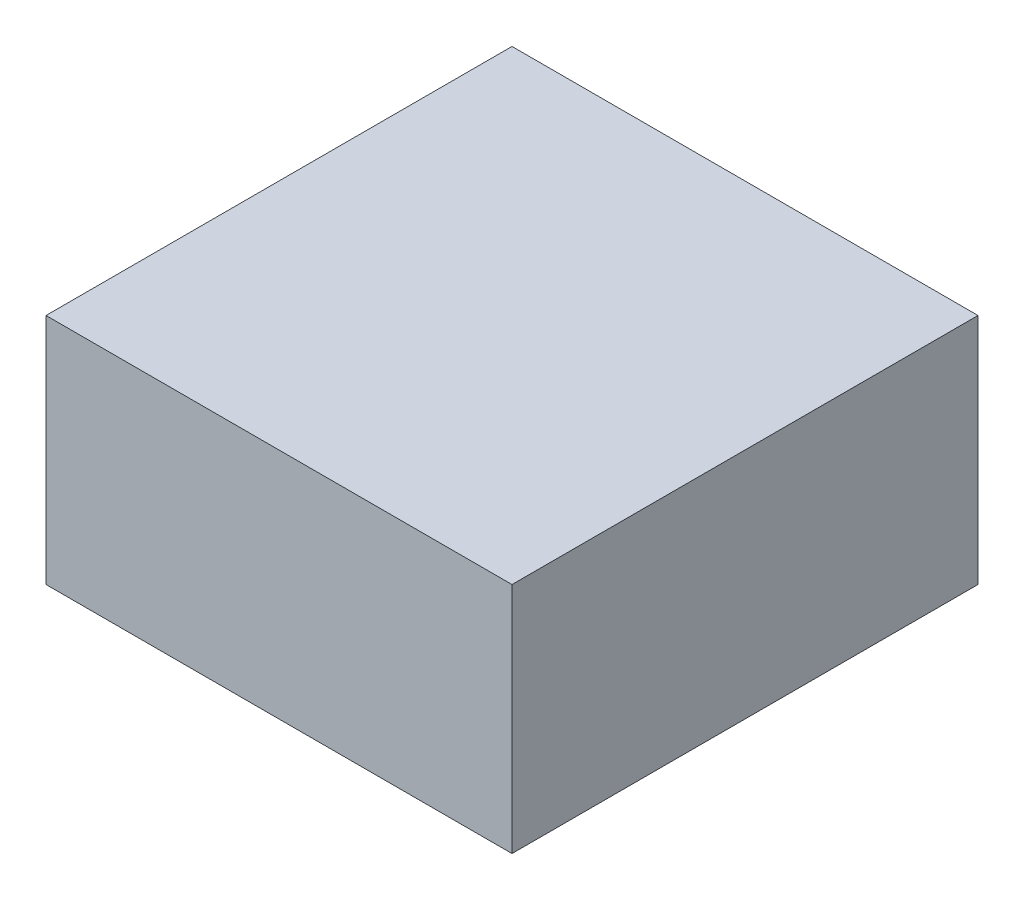
ISO-10303-21;
HEADER;
FILE_DESCRIPTION(('STEP AP214'),'2;1');
FILE_NAME('part.step','',(''),(''),'','','');
FILE_SCHEMA(('AUTOMOTIVE_DESIGN { 1 0 10303 214 1 1 1 1 }'));
ENDSEC;
DATA;
#1=APPLICATION_CONTEXT('core data for automotive mechanical design processes');
#2=APPLICATION_PROTOCOL_DEFINITION('international standard','automotive_design',2000,#1);
#3=PRODUCT_CONTEXT('',#1,'mechanical');
#4=PRODUCT('Part','Part','',(#3));
#5=PRODUCT_RELATED_PRODUCT_CATEGORY('part','',(#4));
#6=PRODUCT_DEFINITION_FORMATION('','',#4);
#7=PRODUCT_DEFINITION_CONTEXT('part definition',#1,'design');
#8=PRODUCT_DEFINITION('design','',#6,#7);
#9=PRODUCT_DEFINITION_SHAPE('','',#8);
#10=(LENGTH_UNIT() NAMED_UNIT(*) SI_UNIT(.MILLI.,.METRE.));
#11=(NAMED_UNIT(*) PLANE_ANGLE_UNIT() SI_UNIT($,.RADIAN.));
#12=(NAMED_UNIT(*) SI_UNIT($,.STERADIAN.) SOLID_ANGLE_UNIT());
#13=UNCERTAINTY_MEASURE_WITH_UNIT(LENGTH_MEASURE(1.E-05),#10,'distance_accuracy_value','');
#14=(GEOMETRIC_REPRESENTATION_CONTEXT(3) GLOBAL_UNCERTAINTY_ASSIGNED_CONTEXT((#13)) GLOBAL_UNIT_ASSIGNED_CONTEXT((#10,
#11,#12)) REPRESENTATION_CONTEXT('',''));
#15=CARTESIAN_POINT('',(0.,0.,0.));
#16=DIRECTION('',(0.,0.,1.));
#17=DIRECTION('',(1.,0.,0.));
#18=AXIS2_PLACEMENT_3D('',#15,#16,#17);
#19=CARTESIAN_POINT('',(0.,20.,0.));
#20=DIRECTION('',(0.,0.,-1.));
#21=DIRECTION('',(-1.,0.,0.));
#22=AXIS2_PLACEMENT_3D('',#19,#20,#21);
#23=PLANE('',#22);
#24=DIRECTION('',(1.,0.,0.));
#25=VECTOR('',#24,1.);
#26=CARTESIAN_POINT('',(0.,0.,0.));
#27=LINE('',#26,#25);
#28=CARTESIAN_POINT('',(0.,0.,0.));
#29=VERTEX_POINT('',#28);
#30=CARTESIAN_POINT('',(40.,0.,0.));
#31=VERTEX_POINT('',#30);
#32=EDGE_CURVE('E140',#29,#31,#27,.T.);
#33=ORIENTED_EDGE('',*,*,#32,.T.);
#34=DIRECTION('',(0.,-1.,0.));
#35=VECTOR('',#34,1.);
#36=CARTESIAN_POINT('',(40.,20.,0.));
#37=LINE('',#36,#35);
#38=CARTESIAN_POINT('',(40.,20.,0.));
#39=VERTEX_POINT('',#38);
#40=EDGE_CURVE('E11',#39,#31,#37,.T.);
#41=ORIENTED_EDGE('',*,*,#40,.F.);
#42=DIRECTION('',(1.,0.,0.));
#43=VECTOR('',#42,1.);
#44=CARTESIAN_POINT('',(0.,20.,0.));
#45=LINE('',#44,#43);
#46=CARTESIAN_POINT('',(0.,20.,0.));
#47=VERTEX_POINT('',#46);
#48=EDGE_CURVE('E144',#47,#39,#45,.T.);
#49=ORIENTED_EDGE('',*,*,#48,.F.);
#50=DIRECTION('',(0.,-1.,0.));
#51=VECTOR('',#50,1.);
#52=CARTESIAN_POINT('',(0.,20.,0.));
#53=LINE('',#52,#51);
#54=EDGE_CURVE('E57',#47,#29,#53,.T.);
#55=ORIENTED_EDGE('',*,*,#54,.T.);
#56=EDGE_LOOP('',(#33,#41,#49,#55));
#57=FACE_BOUND('',#56,.T.);
#58=ADVANCED_FACE('F34',(#57),#23,.F.);
#59=CARTESIAN_POINT('',(40.,20.,0.));
#60=DIRECTION('',(-1.,0.,0.));
#61=DIRECTION('',(0.,0.,1.));
#62=AXIS2_PLACEMENT_3D('',#59,#60,#61);
#63=PLANE('',#62);
#64=DIRECTION('',(0.,0.,-1.));
#65=VECTOR('',#64,1.);
#66=CARTESIAN_POINT('',(40.,0.,0.));
#67=LINE('',#66,#65);
#68=CARTESIAN_POINT('',(40.,0.,-40.));
#69=VERTEX_POINT('',#68);
#70=EDGE_CURVE('E154',#31,#69,#67,.T.);
#71=ORIENTED_EDGE('',*,*,#70,.T.);
#72=DIRECTION('',(0.,-1.,0.));
#73=VECTOR('',#72,1.);
#74=CARTESIAN_POINT('',(40.,20.,-40.));
#75=LINE('',#74,#73);
#76=CARTESIAN_POINT('',(40.,20.,-40.));
#77=VERTEX_POINT('',#76);
#78=EDGE_CURVE('E41',#77,#69,#75,.T.);
#79=ORIENTED_EDGE('',*,*,#78,.F.);
#80=DIRECTION('',(0.,0.,-1.));
#81=VECTOR('',#80,1.);
#82=CARTESIAN_POINT('',(40.,20.,0.));
#83=LINE('',#82,#81);
#84=EDGE_CURVE('E83',#39,#77,#83,.T.);
#85=ORIENTED_EDGE('',*,*,#84,.F.);
#86=ORIENTED_EDGE('',*,*,#40,.T.);
#87=EDGE_LOOP('',(#71,#79,#85,#86));
#88=FACE_BOUND('',#87,.T.);
#89=ADVANCED_FACE('F168',(#88),#63,.F.);
#90=CARTESIAN_POINT('',(0.,20.,-40.));
#91=DIRECTION('',(0.,0.,-1.));
#92=DIRECTION('',(-1.,0.,0.));
#93=AXIS2_PLACEMENT_3D('',#90,#91,#92);
#94=PLANE('',#93);
#95=DIRECTION('',(1.,0.,0.));
#96=VECTOR('',#95,1.);
#97=CARTESIAN_POINT('',(0.,0.,-40.));
#98=LINE('',#97,#96);
#99=CARTESIAN_POINT('',(0.,0.,-40.));
#100=VERTEX_POINT('',#99);
#101=EDGE_CURVE('E157',#100,#69,#98,.T.);
#102=ORIENTED_EDGE('',*,*,#101,.F.);
#103=DIRECTION('',(0.,-1.,0.));
#104=VECTOR('',#103,1.);
#105=CARTESIAN_POINT('',(0.,20.,-40.));
#106=LINE('',#105,#104);
#107=CARTESIAN_POINT('',(0.,20.,-40.));
#108=VERTEX_POINT('',#107);
#109=EDGE_CURVE('E163',#108,#100,#106,.T.);
#110=ORIENTED_EDGE('',*,*,#109,.F.);
#111=DIRECTION('',(1.,0.,0.));
#112=VECTOR('',#111,1.);
#113=CARTESIAN_POINT('',(0.,20.,-40.));
#114=LINE('',#113,#112);
#115=EDGE_CURVE('E148',#108,#77,#114,.T.);
#116=ORIENTED_EDGE('',*,*,#115,.T.);
#117=ORIENTED_EDGE('',*,*,#78,.T.);
#118=EDGE_LOOP('',(#102,#110,#116,#117));
#119=FACE_BOUND('',#118,.T.);
#120=ADVANCED_FACE('F166',(#119),#94,.T.);
#121=CARTESIAN_POINT('',(0.,20.,0.));
#122=DIRECTION('',(-1.,0.,0.));
#123=DIRECTION('',(0.,0.,1.));
#124=AXIS2_PLACEMENT_3D('',#121,#122,#123);
#125=PLANE('',#124);
#126=DIRECTION('',(0.,-1.,0.));
#127=VECTOR('',#126,1.);
#128=CARTESIAN_POINT('',(0.,0.,-36.));
#129=LINE('',#128,#127);
#130=CARTESIAN_POINT('',(0.,16.,-36.));
#131=VERTEX_POINT('',#130);
#132=CARTESIAN_POINT('',(0.,4.,-36.));
#133=VERTEX_POINT('',#132);
#134=EDGE_CURVE('E48',#131,#133,#129,.T.);
#135=ORIENTED_EDGE('',*,*,#134,.F.);
#136=DIRECTION('',(0.,0.,1.));
#137=VECTOR('',#136,1.);
#138=CARTESIAN_POINT('',(0.,16.,0.));
#139=LINE('',#138,#137);
#140=CARTESIAN_POINT('',(0.,16.,-4.));
#141=VERTEX_POINT('',#140);
#142=EDGE_CURVE('E125',#131,#141,#139,.T.);
#143=ORIENTED_EDGE('',*,*,#142,.T.);
#144=DIRECTION('',(0.,-1.,0.));
#145=VECTOR('',#144,1.);
#146=CARTESIAN_POINT('',(0.,0.,-3.99999999999999));
#147=LINE('',#146,#145);
#148=CARTESIAN_POINT('',(0.,4.00000000000001,-3.99999999999999));
#149=VERTEX_POINT('',#148);
#150=EDGE_CURVE('E128',#141,#149,#147,.T.);
#151=ORIENTED_EDGE('',*,*,#150,.T.);
#152=DIRECTION('',(0.,0.,1.));
#153=VECTOR('',#152,1.);
#154=CARTESIAN_POINT('',(0.,4.00000000000001,0.));
#155=LINE('',#154,#153);
#156=EDGE_CURVE('E134',#133,#149,#155,.T.);
#157=ORIENTED_EDGE('',*,*,#156,.F.);
#158=EDGE_LOOP('',(#135,#143,#151,#157));
#159=FACE_BOUND('',#158,.T.);
#160=DIRECTION('',(0.,0.,-1.));
#161=VECTOR('',#160,1.);
#162=CARTESIAN_POINT('',(0.,0.,0.));
#163=LINE('',#162,#161);
#164=EDGE_CURVE('E146',#29,#100,#163,.T.);
#165=ORIENTED_EDGE('',*,*,#164,.F.);
#166=ORIENTED_EDGE('',*,*,#54,.F.);
#167=DIRECTION('',(0.,0.,-1.));
#168=VECTOR('',#167,1.);
#169=CARTESIAN_POINT('',(0.,20.,0.));
#170=LINE('',#169,#168);
#171=EDGE_CURVE('E151',#47,#108,#170,.T.);
#172=ORIENTED_EDGE('',*,*,#171,.T.);
#173=ORIENTED_EDGE('',*,*,#109,.T.);
#174=EDGE_LOOP('',(#165,#166,#172,#173));
#175=FACE_BOUND('',#174,.T.);
#176=ADVANCED_FACE('F172',(#159,#175),#125,.T.);
#177=CARTESIAN_POINT('',(0.,20.,0.));
#178=DIRECTION('',(0.,1.,0.));
#179=DIRECTION('',(0.,0.,1.));
#180=AXIS2_PLACEMENT_3D('',#177,#178,#179);
#181=PLANE('',#180);
#182=ORIENTED_EDGE('',*,*,#48,.T.);
#183=ORIENTED_EDGE('',*,*,#84,.T.);
#184=ORIENTED_EDGE('',*,*,#115,.F.);
#185=ORIENTED_EDGE('',*,*,#171,.F.);
#186=EDGE_LOOP('',(#182,#183,#184,#185));
#187=FACE_BOUND('',#186,.T.);
#188=ADVANCED_FACE('F175',(#187),#181,.T.);
#189=CARTESIAN_POINT('',(0.,0.,0.));
#190=DIRECTION('',(0.,1.,0.));
#191=DIRECTION('',(0.,0.,1.));
#192=AXIS2_PLACEMENT_3D('',#189,#190,#191);
#193=PLANE('',#192);
#194=ORIENTED_EDGE('',*,*,#32,.F.);
#195=ORIENTED_EDGE('',*,*,#164,.T.);
#196=ORIENTED_EDGE('',*,*,#101,.T.);
#197=ORIENTED_EDGE('',*,*,#70,.F.);
#198=EDGE_LOOP('',(#194,#195,#196,#197));
#199=FACE_BOUND('',#198,.T.);
#200=ADVANCED_FACE('F171',(#199),#193,.F.);
#201=CARTESIAN_POINT('',(20.,0.,-36.));
#202=DIRECTION('',(0.,0.,-1.));
#203=DIRECTION('',(0.,1.,0.));
#204=AXIS2_PLACEMENT_3D('',#201,#202,#203);
#205=PLANE('',#204);
#206=ORIENTED_EDGE('',*,*,#134,.T.);
#207=DIRECTION('',(-1.,0.,0.));
#208=VECTOR('',#207,1.);
#209=CARTESIAN_POINT('',(20.,4.,-36.));
#210=LINE('',#209,#208);
#211=CARTESIAN_POINT('',(20.,4.,-36.));
#212=VERTEX_POINT('',#211);
#213=EDGE_CURVE('E104',#212,#133,#210,.T.);
#214=ORIENTED_EDGE('',*,*,#213,.F.);
#215=DIRECTION('',(0.,-1.,0.));
#216=VECTOR('',#215,1.);
#217=CARTESIAN_POINT('',(20.,0.,-36.));
#218=LINE('',#217,#216);
#219=CARTESIAN_POINT('',(20.,16.,-36.));
#220=VERTEX_POINT('',#219);
#221=EDGE_CURVE('E108',#220,#212,#218,.T.);
#222=ORIENTED_EDGE('',*,*,#221,.F.);
#223=DIRECTION('',(-1.,0.,0.));
#224=VECTOR('',#223,1.);
#225=CARTESIAN_POINT('',(20.,16.,-36.));
#226=LINE('',#225,#224);
#227=EDGE_CURVE('E138',#220,#131,#226,.T.);
#228=ORIENTED_EDGE('',*,*,#227,.T.);
#229=EDGE_LOOP('',(#206,#214,#222,#228));
#230=FACE_BOUND('',#229,.T.);
#231=ADVANCED_FACE('F106',(#230),#205,.F.);
#232=CARTESIAN_POINT('',(20.,16.,0.));
#233=DIRECTION('',(0.,-1.,0.));
#234=DIRECTION('',(0.,0.,-1.));
#235=AXIS2_PLACEMENT_3D('',#232,#233,#234);
#236=PLANE('',#235);
#237=ORIENTED_EDGE('',*,*,#142,.F.);
#238=ORIENTED_EDGE('',*,*,#227,.F.);
#239=DIRECTION('',(0.,0.,1.));
#240=VECTOR('',#239,1.);
#241=CARTESIAN_POINT('',(20.,16.,0.));
#242=LINE('',#241,#240);
#243=CARTESIAN_POINT('',(20.,16.,-4.));
#244=VERTEX_POINT('',#243);
#245=EDGE_CURVE('E113',#220,#244,#242,.T.);
#246=ORIENTED_EDGE('',*,*,#245,.T.);
#247=DIRECTION('',(-1.,0.,0.));
#248=VECTOR('',#247,1.);
#249=CARTESIAN_POINT('',(20.,16.,-4.));
#250=LINE('',#249,#248);
#251=EDGE_CURVE('E141',#244,#141,#250,.T.);
#252=ORIENTED_EDGE('',*,*,#251,.T.);
#253=EDGE_LOOP('',(#237,#238,#246,#252));
#254=FACE_BOUND('',#253,.T.);
#255=ADVANCED_FACE('F194',(#254),#236,.T.);
#256=CARTESIAN_POINT('',(20.,0.,-3.99999999999999));
#257=DIRECTION('',(0.,0.,-1.));
#258=DIRECTION('',(0.,1.,0.));
#259=AXIS2_PLACEMENT_3D('',#256,#257,#258);
#260=PLANE('',#259);
#261=ORIENTED_EDGE('',*,*,#150,.F.);
#262=ORIENTED_EDGE('',*,*,#251,.F.);
#263=DIRECTION('',(0.,-1.,0.));
#264=VECTOR('',#263,1.);
#265=CARTESIAN_POINT('',(20.,0.,-3.99999999999999));
#266=LINE('',#265,#264);
#267=CARTESIAN_POINT('',(20.,4.00000000000001,-3.99999999999999));
#268=VERTEX_POINT('',#267);
#269=EDGE_CURVE('E121',#244,#268,#266,.T.);
#270=ORIENTED_EDGE('',*,*,#269,.T.);
#271=DIRECTION('',(-1.,0.,0.));
#272=VECTOR('',#271,1.);
#273=CARTESIAN_POINT('',(20.,4.00000000000001,-3.99999999999999));
#274=LINE('',#273,#272);
#275=EDGE_CURVE('E112',#268,#149,#274,.T.);
#276=ORIENTED_EDGE('',*,*,#275,.T.);
#277=EDGE_LOOP('',(#261,#262,#270,#276));
#278=FACE_BOUND('',#277,.T.);
#279=ADVANCED_FACE('F197',(#278),#260,.T.);
#280=CARTESIAN_POINT('',(20.,4.00000000000001,0.));
#281=DIRECTION('',(0.,-1.,0.));
#282=DIRECTION('',(0.,0.,-1.));
#283=AXIS2_PLACEMENT_3D('',#280,#281,#282);
#284=PLANE('',#283);
#285=ORIENTED_EDGE('',*,*,#156,.T.);
#286=ORIENTED_EDGE('',*,*,#275,.F.);
#287=DIRECTION('',(0.,0.,1.));
#288=VECTOR('',#287,1.);
#289=CARTESIAN_POINT('',(20.,4.00000000000001,0.));
#290=LINE('',#289,#288);
#291=EDGE_CURVE('E117',#212,#268,#290,.T.);
#292=ORIENTED_EDGE('',*,*,#291,.F.);
#293=ORIENTED_EDGE('',*,*,#213,.T.);
#294=EDGE_LOOP('',(#285,#286,#292,#293));
#295=FACE_BOUND('',#294,.T.);
#296=ADVANCED_FACE('F118',(#295),#284,.F.);
#297=CARTESIAN_POINT('',(20.,0.,0.));
#298=DIRECTION('',(-1.,0.,0.));
#299=DIRECTION('',(0.,0.,1.));
#300=AXIS2_PLACEMENT_3D('',#297,#298,#299);
#301=PLANE('',#300);
#302=ORIENTED_EDGE('',*,*,#221,.T.);
#303=ORIENTED_EDGE('',*,*,#291,.T.);
#304=ORIENTED_EDGE('',*,*,#269,.F.);
#305=ORIENTED_EDGE('',*,*,#245,.F.);
#306=EDGE_LOOP('',(#302,#303,#304,#305));
#307=FACE_BOUND('',#306,.T.);
#308=ADVANCED_FACE('F124',(#307),#301,.T.);
#309=CLOSED_SHELL('',(#58,#89,#120,#176,#188,#200,#231,#255,#279,#296,#308));
#310=MANIFOLD_SOLID_BREP('B2',#309);
#311=ADVANCED_BREP_SHAPE_REPRESENTATION('',(#18,#310),#14);
#312=SHAPE_DEFINITION_REPRESENTATION(#9,#311);
ENDSEC;
END-ISO-10303-21;
